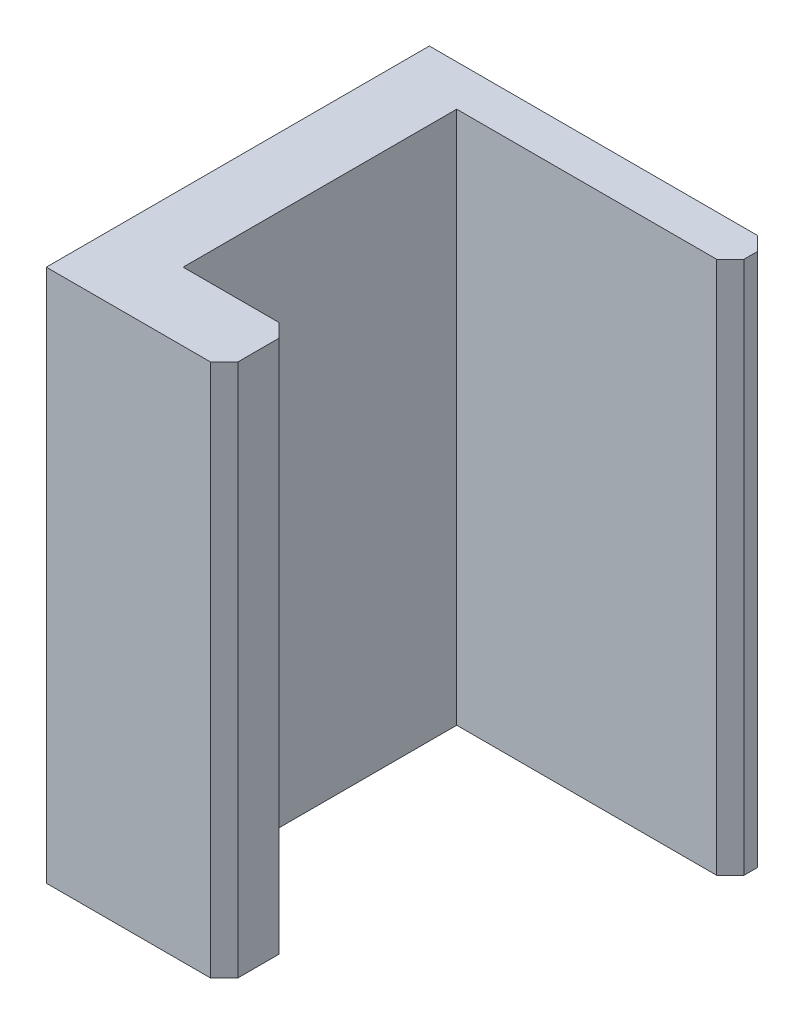
ISO-10303-21;
HEADER;
FILE_DESCRIPTION(('STEP AP214'),'2;1');
FILE_NAME('part.step','',(''),(''),'','','');
FILE_SCHEMA(('AUTOMOTIVE_DESIGN { 1 0 10303 214 1 1 1 1 }'));
ENDSEC;
DATA;
#1=APPLICATION_CONTEXT('core data for automotive mechanical design processes');
#2=APPLICATION_PROTOCOL_DEFINITION('international standard','automotive_design',2000,#1);
#3=PRODUCT_CONTEXT('',#1,'mechanical');
#4=PRODUCT('Part','Part','',(#3));
#5=PRODUCT_RELATED_PRODUCT_CATEGORY('part','',(#4));
#6=PRODUCT_DEFINITION_FORMATION('','',#4);
#7=PRODUCT_DEFINITION_CONTEXT('part definition',#1,'design');
#8=PRODUCT_DEFINITION('design','',#6,#7);
#9=PRODUCT_DEFINITION_SHAPE('','',#8);
#10=(LENGTH_UNIT() NAMED_UNIT(*) SI_UNIT(.MILLI.,.METRE.));
#11=(NAMED_UNIT(*) PLANE_ANGLE_UNIT() SI_UNIT($,.RADIAN.));
#12=(NAMED_UNIT(*) SI_UNIT($,.STERADIAN.) SOLID_ANGLE_UNIT());
#13=UNCERTAINTY_MEASURE_WITH_UNIT(LENGTH_MEASURE(1.E-05),#10,'distance_accuracy_value','');
#14=(GEOMETRIC_REPRESENTATION_CONTEXT(3) GLOBAL_UNCERTAINTY_ASSIGNED_CONTEXT((#13)) GLOBAL_UNIT_ASSIGNED_CONTEXT((#10,
#11,#12)) REPRESENTATION_CONTEXT('',''));
#15=CARTESIAN_POINT('',(0.,0.,0.));
#16=DIRECTION('',(0.,0.,1.));
#17=DIRECTION('',(1.,0.,0.));
#18=AXIS2_PLACEMENT_3D('',#15,#16,#17);
#19=CARTESIAN_POINT('',(0.125,0.975,0.5));
#20=DIRECTION('',(-1.,0.,0.));
#21=DIRECTION('',(0.,0.,1.));
#22=AXIS2_PLACEMENT_3D('',#19,#20,#21);
#23=PLANE('',#22);
#24=DIRECTION('',(0.,1.,0.));
#25=VECTOR('',#24,1.);
#26=CARTESIAN_POINT('',(0.125,0.975,-0.5));
#27=LINE('',#26,#25);
#28=CARTESIAN_POINT('',(0.125,-0.975,-0.5));
#29=VERTEX_POINT('',#28);
#30=CARTESIAN_POINT('',(0.125,0.975,-0.5));
#31=VERTEX_POINT('',#30);
#32=EDGE_CURVE('E117',#29,#31,#27,.T.);
#33=ORIENTED_EDGE('',*,*,#32,.T.);
#34=DIRECTION('',(0.,0.,1.));
#35=VECTOR('',#34,1.);
#36=CARTESIAN_POINT('',(0.125,0.975,0.5));
#37=LINE('',#36,#35);
#38=CARTESIAN_POINT('',(0.125,0.975,0.5));
#39=VERTEX_POINT('',#38);
#40=EDGE_CURVE('E20',#39,#31,#37,.F.);
#41=ORIENTED_EDGE('',*,*,#40,.F.);
#42=DIRECTION('',(0.,1.,0.));
#43=VECTOR('',#42,1.);
#44=CARTESIAN_POINT('',(0.125,0.975,0.5));
#45=LINE('',#44,#43);
#46=CARTESIAN_POINT('',(0.125,-0.975,0.5));
#47=VERTEX_POINT('',#46);
#48=EDGE_CURVE('E126',#39,#47,#45,.F.);
#49=ORIENTED_EDGE('',*,*,#48,.T.);
#50=DIRECTION('',(0.,0.,1.));
#51=VECTOR('',#50,1.);
#52=CARTESIAN_POINT('',(0.125,-0.975,0.5));
#53=LINE('',#52,#51);
#54=EDGE_CURVE('E102',#29,#47,#53,.T.);
#55=ORIENTED_EDGE('',*,*,#54,.F.);
#56=EDGE_LOOP('',(#33,#41,#49,#55));
#57=FACE_BOUND('',#56,.T.);
#58=ADVANCED_FACE('F17',(#57),#23,.F.);
#59=CARTESIAN_POINT('',(0.125,0.975,-0.5));
#60=DIRECTION('',(0.,0.,-1.));
#61=DIRECTION('',(-1.,0.,0.));
#62=AXIS2_PLACEMENT_3D('',#59,#60,#61);
#63=PLANE('',#62);
#64=DIRECTION('',(0.,1.,0.));
#65=VECTOR('',#64,1.);
#66=CARTESIAN_POINT('',(1.075,0.975,-0.5));
#67=LINE('',#66,#65);
#68=CARTESIAN_POINT('',(1.075,-0.975,-0.5));
#69=VERTEX_POINT('',#68);
#70=CARTESIAN_POINT('',(1.075,0.975,-0.5));
#71=VERTEX_POINT('',#70);
#72=EDGE_CURVE('E120',#69,#71,#67,.T.);
#73=ORIENTED_EDGE('',*,*,#72,.T.);
#74=DIRECTION('',(-1.,0.,0.));
#75=VECTOR('',#74,1.);
#76=CARTESIAN_POINT('',(0.125,0.975,-0.5));
#77=LINE('',#76,#75);
#78=EDGE_CURVE('E109',#31,#71,#77,.F.);
#79=ORIENTED_EDGE('',*,*,#78,.F.);
#80=ORIENTED_EDGE('',*,*,#32,.F.);
#81=DIRECTION('',(-1.,0.,0.));
#82=VECTOR('',#81,1.);
#83=CARTESIAN_POINT('',(0.125,-0.975,-0.5));
#84=LINE('',#83,#82);
#85=EDGE_CURVE('E121',#69,#29,#84,.T.);
#86=ORIENTED_EDGE('',*,*,#85,.F.);
#87=EDGE_LOOP('',(#73,#79,#80,#86));
#88=FACE_BOUND('',#87,.T.);
#89=ADVANCED_FACE('F116',(#88),#63,.F.);
#90=CARTESIAN_POINT('',(0.525,0.975,0.5));
#91=DIRECTION('',(0.,0.,1.));
#92=DIRECTION('',(1.,0.,0.));
#93=AXIS2_PLACEMENT_3D('',#90,#91,#92);
#94=PLANE('',#93);
#95=DIRECTION('',(0.,1.,0.));
#96=VECTOR('',#95,1.);
#97=CARTESIAN_POINT('',(0.475,0.975,0.5));
#98=LINE('',#97,#96);
#99=CARTESIAN_POINT('',(0.475,0.975,0.5));
#100=VERTEX_POINT('',#99);
#101=CARTESIAN_POINT('',(0.475,-0.975,0.5));
#102=VERTEX_POINT('',#101);
#103=EDGE_CURVE('E137',#100,#102,#98,.F.);
#104=ORIENTED_EDGE('',*,*,#103,.T.);
#105=DIRECTION('',(1.,0.,0.));
#106=VECTOR('',#105,1.);
#107=CARTESIAN_POINT('',(0.525,-0.975,0.5));
#108=LINE('',#107,#106);
#109=EDGE_CURVE('E128',#47,#102,#108,.T.);
#110=ORIENTED_EDGE('',*,*,#109,.F.);
#111=ORIENTED_EDGE('',*,*,#48,.F.);
#112=DIRECTION('',(1.,0.,0.));
#113=VECTOR('',#112,1.);
#114=CARTESIAN_POINT('',(0.525,0.975,0.5));
#115=LINE('',#114,#113);
#116=EDGE_CURVE('E112',#100,#39,#115,.F.);
#117=ORIENTED_EDGE('',*,*,#116,.F.);
#118=EDGE_LOOP('',(#104,#110,#111,#117));
#119=FACE_BOUND('',#118,.T.);
#120=ADVANCED_FACE('F249',(#119),#94,.F.);
#121=CARTESIAN_POINT('',(1.125,0.975,-0.55));
#122=DIRECTION('',(-0.707106781186548,0.,-0.707106781186548));
#123=DIRECTION('',(-0.707106781186548,0.,0.707106781186548));
#124=AXIS2_PLACEMENT_3D('',#121,#122,#123);
#125=PLANE('',#124);
#126=ORIENTED_EDGE('',*,*,#72,.F.);
#127=DIRECTION('',(-0.707106781186548,0.,0.707106781186548));
#128=VECTOR('',#127,1.);
#129=CARTESIAN_POINT('',(1.125,-0.975000000000001,-0.55));
#130=LINE('',#129,#128);
#131=CARTESIAN_POINT('',(1.125,-0.975,-0.55));
#132=VERTEX_POINT('',#131);
#133=EDGE_CURVE('E131',#132,#69,#130,.T.);
#134=ORIENTED_EDGE('',*,*,#133,.F.);
#135=DIRECTION('',(0.,1.,0.));
#136=VECTOR('',#135,1.);
#137=CARTESIAN_POINT('',(1.125,0.975,-0.55));
#138=LINE('',#137,#136);
#139=CARTESIAN_POINT('',(1.125,0.975,-0.55));
#140=VERTEX_POINT('',#139);
#141=EDGE_CURVE('E144',#132,#140,#138,.T.);
#142=ORIENTED_EDGE('',*,*,#141,.T.);
#143=DIRECTION('',(-0.707106781186548,0.,0.707106781186548));
#144=VECTOR('',#143,1.);
#145=CARTESIAN_POINT('',(1.125,0.975,-0.55));
#146=LINE('',#145,#144);
#147=EDGE_CURVE('E135',#71,#140,#146,.F.);
#148=ORIENTED_EDGE('',*,*,#147,.F.);
#149=EDGE_LOOP('',(#126,#134,#142,#148));
#150=FACE_BOUND('',#149,.T.);
#151=ADVANCED_FACE('F245',(#150),#125,.F.);
#152=CARTESIAN_POINT('',(0.475,0.975,0.5));
#153=DIRECTION('',(-0.707106781186548,0.,0.707106781186548));
#154=DIRECTION('',(0.707106781186548,0.,0.707106781186548));
#155=AXIS2_PLACEMENT_3D('',#152,#153,#154);
#156=PLANE('',#155);
#157=DIRECTION('',(0.,1.,0.));
#158=VECTOR('',#157,1.);
#159=CARTESIAN_POINT('',(0.525,0.975,0.55));
#160=LINE('',#159,#158);
#161=CARTESIAN_POINT('',(0.525,0.975,0.55));
#162=VERTEX_POINT('',#161);
#163=CARTESIAN_POINT('',(0.525,-0.975000000000001,0.55));
#164=VERTEX_POINT('',#163);
#165=EDGE_CURVE('E155',#162,#164,#160,.F.);
#166=ORIENTED_EDGE('',*,*,#165,.T.);
#167=DIRECTION('',(0.707106781186548,0.,0.707106781186548));
#168=VECTOR('',#167,1.);
#169=CARTESIAN_POINT('',(0.475,-0.975000000000001,0.5));
#170=LINE('',#169,#168);
#171=EDGE_CURVE('E140',#102,#164,#170,.T.);
#172=ORIENTED_EDGE('',*,*,#171,.F.);
#173=ORIENTED_EDGE('',*,*,#103,.F.);
#174=DIRECTION('',(0.707106781186548,0.,0.707106781186548));
#175=VECTOR('',#174,1.);
#176=CARTESIAN_POINT('',(0.475,0.975,0.5));
#177=LINE('',#176,#175);
#178=EDGE_CURVE('E142',#162,#100,#177,.F.);
#179=ORIENTED_EDGE('',*,*,#178,.F.);
#180=EDGE_LOOP('',(#166,#172,#173,#179));
#181=FACE_BOUND('',#180,.T.);
#182=ADVANCED_FACE('F241',(#181),#156,.F.);
#183=CARTESIAN_POINT('',(1.125,0.975,-0.5));
#184=DIRECTION('',(-1.,0.,0.));
#185=DIRECTION('',(0.,0.,1.));
#186=AXIS2_PLACEMENT_3D('',#183,#184,#185);
#187=PLANE('',#186);
#188=DIRECTION('',(0.,1.,0.));
#189=VECTOR('',#188,1.);
#190=CARTESIAN_POINT('',(1.125,0.975,-0.6));
#191=LINE('',#190,#189);
#192=CARTESIAN_POINT('',(1.125,-0.975,-0.6));
#193=VERTEX_POINT('',#192);
#194=CARTESIAN_POINT('',(1.125,0.975,-0.6));
#195=VERTEX_POINT('',#194);
#196=EDGE_CURVE('E163',#193,#195,#191,.T.);
#197=ORIENTED_EDGE('',*,*,#196,.T.);
#198=DIRECTION('',(0.,0.,1.));
#199=VECTOR('',#198,1.);
#200=CARTESIAN_POINT('',(1.125,0.975,-0.5));
#201=LINE('',#200,#199);
#202=EDGE_CURVE('E147',#140,#195,#201,.F.);
#203=ORIENTED_EDGE('',*,*,#202,.F.);
#204=ORIENTED_EDGE('',*,*,#141,.F.);
#205=DIRECTION('',(0.,0.,1.));
#206=VECTOR('',#205,1.);
#207=CARTESIAN_POINT('',(1.125,-0.975,-0.5));
#208=LINE('',#207,#206);
#209=EDGE_CURVE('E149',#193,#132,#208,.T.);
#210=ORIENTED_EDGE('',*,*,#209,.F.);
#211=EDGE_LOOP('',(#197,#203,#204,#210));
#212=FACE_BOUND('',#211,.T.);
#213=ADVANCED_FACE('F237',(#212),#187,.F.);
#214=CARTESIAN_POINT('',(0.525,0.975,0.75));
#215=DIRECTION('',(-1.,0.,0.));
#216=DIRECTION('',(0.,0.,1.));
#217=AXIS2_PLACEMENT_3D('',#214,#215,#216);
#218=PLANE('',#217);
#219=ORIENTED_EDGE('',*,*,#165,.F.);
#220=DIRECTION('',(0.,0.,1.));
#221=VECTOR('',#220,1.);
#222=CARTESIAN_POINT('',(0.525,0.975,0.75));
#223=LINE('',#222,#221);
#224=CARTESIAN_POINT('',(0.525,0.975,0.7));
#225=VERTEX_POINT('',#224);
#226=EDGE_CURVE('E152',#225,#162,#223,.F.);
#227=ORIENTED_EDGE('',*,*,#226,.F.);
#228=DIRECTION('',(0.,1.,0.));
#229=VECTOR('',#228,1.);
#230=CARTESIAN_POINT('',(0.525,0.975,0.7));
#231=LINE('',#230,#229);
#232=CARTESIAN_POINT('',(0.525,-0.975,0.7));
#233=VERTEX_POINT('',#232);
#234=EDGE_CURVE('E168',#225,#233,#231,.F.);
#235=ORIENTED_EDGE('',*,*,#234,.T.);
#236=DIRECTION('',(0.,0.,1.));
#237=VECTOR('',#236,1.);
#238=CARTESIAN_POINT('',(0.525,-0.975,0.75));
#239=LINE('',#238,#237);
#240=EDGE_CURVE('E158',#164,#233,#239,.T.);
#241=ORIENTED_EDGE('',*,*,#240,.F.);
#242=EDGE_LOOP('',(#219,#227,#235,#241));
#243=FACE_BOUND('',#242,.T.);
#244=ADVANCED_FACE('F233',(#243),#218,.F.);
#245=CARTESIAN_POINT('',(1.075,0.975,-0.65));
#246=DIRECTION('',(-0.707106781186548,0.,0.707106781186548));
#247=DIRECTION('',(0.707106781186548,0.,0.707106781186548));
#248=AXIS2_PLACEMENT_3D('',#245,#246,#247);
#249=PLANE('',#248);
#250=ORIENTED_EDGE('',*,*,#196,.F.);
#251=DIRECTION('',(0.707106781186548,0.,0.707106781186548));
#252=VECTOR('',#251,1.);
#253=CARTESIAN_POINT('',(1.075,-0.975000000000001,-0.65));
#254=LINE('',#253,#252);
#255=CARTESIAN_POINT('',(1.075,-0.975,-0.65));
#256=VERTEX_POINT('',#255);
#257=EDGE_CURVE('E160',#256,#193,#254,.T.);
#258=ORIENTED_EDGE('',*,*,#257,.F.);
#259=DIRECTION('',(0.,1.,0.));
#260=VECTOR('',#259,1.);
#261=CARTESIAN_POINT('',(1.075,0.975,-0.65));
#262=LINE('',#261,#260);
#263=CARTESIAN_POINT('',(1.075,0.975,-0.65));
#264=VERTEX_POINT('',#263);
#265=EDGE_CURVE('E173',#256,#264,#262,.T.);
#266=ORIENTED_EDGE('',*,*,#265,.T.);
#267=DIRECTION('',(0.707106781186548,0.,0.707106781186548));
#268=VECTOR('',#267,1.);
#269=CARTESIAN_POINT('',(1.075,0.975,-0.65));
#270=LINE('',#269,#268);
#271=EDGE_CURVE('E166',#195,#264,#270,.F.);
#272=ORIENTED_EDGE('',*,*,#271,.F.);
#273=EDGE_LOOP('',(#250,#258,#266,#272));
#274=FACE_BOUND('',#273,.T.);
#275=ADVANCED_FACE('F229',(#274),#249,.F.);
#276=CARTESIAN_POINT('',(0.525,0.975,0.7));
#277=DIRECTION('',(-0.707106781186548,0.,-0.707106781186548));
#278=DIRECTION('',(-0.707106781186548,0.,0.707106781186548));
#279=AXIS2_PLACEMENT_3D('',#276,#277,#278);
#280=PLANE('',#279);
#281=DIRECTION('',(0.,1.,0.));
#282=VECTOR('',#281,1.);
#283=CARTESIAN_POINT('',(0.475,0.975,0.75));
#284=LINE('',#283,#282);
#285=CARTESIAN_POINT('',(0.475,0.975,0.75));
#286=VERTEX_POINT('',#285);
#287=CARTESIAN_POINT('',(0.475,-0.975000000000001,0.75));
#288=VERTEX_POINT('',#287);
#289=EDGE_CURVE('E184',#286,#288,#284,.F.);
#290=ORIENTED_EDGE('',*,*,#289,.T.);
#291=DIRECTION('',(-0.707106781186548,0.,0.707106781186548));
#292=VECTOR('',#291,1.);
#293=CARTESIAN_POINT('',(0.525,-0.975000000000001,0.7));
#294=LINE('',#293,#292);
#295=EDGE_CURVE('E171',#233,#288,#294,.T.);
#296=ORIENTED_EDGE('',*,*,#295,.F.);
#297=ORIENTED_EDGE('',*,*,#234,.F.);
#298=DIRECTION('',(0.707106781186548,0.,-0.707106781186547));
#299=VECTOR('',#298,1.);
#300=CARTESIAN_POINT('',(0.475,0.975,0.75));
#301=LINE('',#300,#299);
#302=EDGE_CURVE('E178',#286,#225,#301,.T.);
#303=ORIENTED_EDGE('',*,*,#302,.F.);
#304=EDGE_LOOP('',(#290,#296,#297,#303));
#305=FACE_BOUND('',#304,.T.);
#306=ADVANCED_FACE('F226',(#305),#280,.F.);
#307=CARTESIAN_POINT('',(1.125,0.975,-0.65));
#308=DIRECTION('',(0.,0.,1.));
#309=DIRECTION('',(1.,0.,0.));
#310=AXIS2_PLACEMENT_3D('',#307,#308,#309);
#311=PLANE('',#310);
#312=ORIENTED_EDGE('',*,*,#265,.F.);
#313=DIRECTION('',(1.,0.,0.));
#314=VECTOR('',#313,1.);
#315=CARTESIAN_POINT('',(0.,-0.975,-0.65));
#316=LINE('',#315,#314);
#317=CARTESIAN_POINT('',(-0.125,-0.975,-0.65));
#318=VERTEX_POINT('',#317);
#319=EDGE_CURVE('E188',#256,#318,#316,.F.);
#320=ORIENTED_EDGE('',*,*,#319,.T.);
#321=DIRECTION('',(0.,1.,0.));
#322=VECTOR('',#321,1.);
#323=CARTESIAN_POINT('',(-0.125,0.975,-0.65));
#324=LINE('',#323,#322);
#325=CARTESIAN_POINT('',(-0.125,0.975,-0.65));
#326=VERTEX_POINT('',#325);
#327=EDGE_CURVE('E191',#318,#326,#324,.T.);
#328=ORIENTED_EDGE('',*,*,#327,.T.);
#329=DIRECTION('',(1.,0.,0.));
#330=VECTOR('',#329,1.);
#331=CARTESIAN_POINT('',(0.,0.975,-0.65));
#332=LINE('',#331,#330);
#333=EDGE_CURVE('E176',#264,#326,#332,.F.);
#334=ORIENTED_EDGE('',*,*,#333,.F.);
#335=EDGE_LOOP('',(#312,#320,#328,#334));
#336=FACE_BOUND('',#335,.T.);
#337=ADVANCED_FACE('F209',(#336),#311,.F.);
#338=CARTESIAN_POINT('',(0.,0.975,0.));
#339=DIRECTION('',(0.,1.,0.));
#340=DIRECTION('',(0.,0.,1.));
#341=AXIS2_PLACEMENT_3D('',#338,#339,#340);
#342=PLANE('',#341);
#343=ORIENTED_EDGE('',*,*,#78,.T.);
#344=ORIENTED_EDGE('',*,*,#147,.T.);
#345=ORIENTED_EDGE('',*,*,#202,.T.);
#346=ORIENTED_EDGE('',*,*,#271,.T.);
#347=ORIENTED_EDGE('',*,*,#333,.T.);
#348=DIRECTION('',(0.,0.,-1.));
#349=VECTOR('',#348,1.);
#350=CARTESIAN_POINT('',(-0.125,0.975,-0.65));
#351=LINE('',#350,#349);
#352=CARTESIAN_POINT('',(-0.125,0.975,0.75));
#353=VERTEX_POINT('',#352);
#354=EDGE_CURVE('E194',#326,#353,#351,.F.);
#355=ORIENTED_EDGE('',*,*,#354,.T.);
#356=DIRECTION('',(-1.,0.,0.));
#357=VECTOR('',#356,1.);
#358=CARTESIAN_POINT('',(-0.125,0.975,0.75));
#359=LINE('',#358,#357);
#360=EDGE_CURVE('E181',#353,#286,#359,.F.);
#361=ORIENTED_EDGE('',*,*,#360,.T.);
#362=ORIENTED_EDGE('',*,*,#302,.T.);
#363=ORIENTED_EDGE('',*,*,#226,.T.);
#364=ORIENTED_EDGE('',*,*,#178,.T.);
#365=ORIENTED_EDGE('',*,*,#116,.T.);
#366=ORIENTED_EDGE('',*,*,#40,.T.);
#367=EDGE_LOOP('',(#343,#344,#345,#346,#347,#355,#361,#362,#363,#364,#365,#366));
#368=FACE_BOUND('',#367,.T.);
#369=ADVANCED_FACE('F108',(#368),#342,.T.);
#370=CARTESIAN_POINT('',(-0.125,0.975,0.75));
#371=DIRECTION('',(0.,0.,-1.));
#372=DIRECTION('',(-1.,0.,0.));
#373=AXIS2_PLACEMENT_3D('',#370,#371,#372);
#374=PLANE('',#373);
#375=ORIENTED_EDGE('',*,*,#289,.F.);
#376=ORIENTED_EDGE('',*,*,#360,.F.);
#377=DIRECTION('',(0.,1.,0.));
#378=VECTOR('',#377,1.);
#379=CARTESIAN_POINT('',(-0.125,0.975,0.75));
#380=LINE('',#379,#378);
#381=CARTESIAN_POINT('',(-0.125,-0.975,0.75));
#382=VERTEX_POINT('',#381);
#383=EDGE_CURVE('E26',#353,#382,#380,.F.);
#384=ORIENTED_EDGE('',*,*,#383,.T.);
#385=DIRECTION('',(1.,0.,0.));
#386=VECTOR('',#385,1.);
#387=CARTESIAN_POINT('',(0.,-0.975,0.75));
#388=LINE('',#387,#386);
#389=EDGE_CURVE('E34',#382,#288,#388,.T.);
#390=ORIENTED_EDGE('',*,*,#389,.T.);
#391=EDGE_LOOP('',(#375,#376,#384,#390));
#392=FACE_BOUND('',#391,.T.);
#393=ADVANCED_FACE('F201',(#392),#374,.F.);
#394=CARTESIAN_POINT('',(0.,-0.975,0.));
#395=DIRECTION('',(0.,1.,0.));
#396=DIRECTION('',(0.,0.,1.));
#397=AXIS2_PLACEMENT_3D('',#394,#395,#396);
#398=PLANE('',#397);
#399=ORIENTED_EDGE('',*,*,#257,.T.);
#400=ORIENTED_EDGE('',*,*,#209,.T.);
#401=ORIENTED_EDGE('',*,*,#133,.T.);
#402=ORIENTED_EDGE('',*,*,#85,.T.);
#403=ORIENTED_EDGE('',*,*,#54,.T.);
#404=ORIENTED_EDGE('',*,*,#109,.T.);
#405=ORIENTED_EDGE('',*,*,#171,.T.);
#406=ORIENTED_EDGE('',*,*,#240,.T.);
#407=ORIENTED_EDGE('',*,*,#295,.T.);
#408=ORIENTED_EDGE('',*,*,#389,.F.);
#409=DIRECTION('',(0.,0.,-1.));
#410=VECTOR('',#409,1.);
#411=CARTESIAN_POINT('',(-0.125,-0.975,-0.65));
#412=LINE('',#411,#410);
#413=EDGE_CURVE('E11',#382,#318,#412,.T.);
#414=ORIENTED_EDGE('',*,*,#413,.T.);
#415=ORIENTED_EDGE('',*,*,#319,.F.);
#416=EDGE_LOOP('',(#399,#400,#401,#402,#403,#404,#405,#406,#407,#408,#414,#415));
#417=FACE_BOUND('',#416,.T.);
#418=ADVANCED_FACE('F211',(#417),#398,.F.);
#419=CARTESIAN_POINT('',(-0.125,0.975,-0.65));
#420=DIRECTION('',(1.,0.,0.));
#421=DIRECTION('',(0.,0.,-1.));
#422=AXIS2_PLACEMENT_3D('',#419,#420,#421);
#423=PLANE('',#422);
#424=ORIENTED_EDGE('',*,*,#383,.F.);
#425=ORIENTED_EDGE('',*,*,#354,.F.);
#426=ORIENTED_EDGE('',*,*,#327,.F.);
#427=ORIENTED_EDGE('',*,*,#413,.F.);
#428=EDGE_LOOP('',(#424,#425,#426,#427));
#429=FACE_BOUND('',#428,.T.);
#430=ADVANCED_FACE('F204',(#429),#423,.F.);
#431=CLOSED_SHELL('',(#58,#89,#120,#151,#182,#213,#244,#275,#306,#337,#369,#393,#418,#430));
#432=MANIFOLD_SOLID_BREP('B1',#431);
#433=ADVANCED_BREP_SHAPE_REPRESENTATION('',(#18,#432),#14);
#434=SHAPE_DEFINITION_REPRESENTATION(#9,#433);
ENDSEC;
END-ISO-10303-21;
